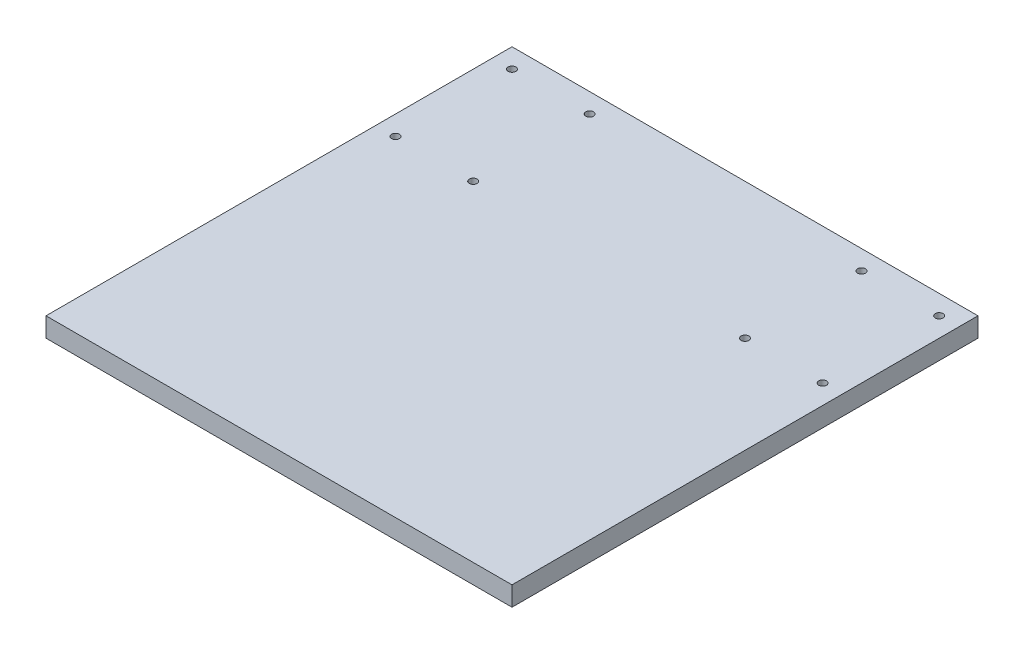
ISO-10303-21;
HEADER;
FILE_DESCRIPTION(('STEP AP214'),'2;1');
FILE_NAME('part.step','',(''),(''),'','','');
FILE_SCHEMA(('AUTOMOTIVE_DESIGN { 1 0 10303 214 1 1 1 1 }'));
ENDSEC;
DATA;
#1=APPLICATION_CONTEXT('core data for automotive mechanical design processes');
#2=APPLICATION_PROTOCOL_DEFINITION('international standard','automotive_design',2000,#1);
#3=PRODUCT_CONTEXT('',#1,'mechanical');
#4=PRODUCT('Part','Part','',(#3));
#5=PRODUCT_RELATED_PRODUCT_CATEGORY('part','',(#4));
#6=PRODUCT_DEFINITION_FORMATION('','',#4);
#7=PRODUCT_DEFINITION_CONTEXT('part definition',#1,'design');
#8=PRODUCT_DEFINITION('design','',#6,#7);
#9=PRODUCT_DEFINITION_SHAPE('','',#8);
#10=(LENGTH_UNIT() NAMED_UNIT(*) SI_UNIT(.MILLI.,.METRE.));
#11=(NAMED_UNIT(*) PLANE_ANGLE_UNIT() SI_UNIT($,.RADIAN.));
#12=(NAMED_UNIT(*) SI_UNIT($,.STERADIAN.) SOLID_ANGLE_UNIT());
#13=UNCERTAINTY_MEASURE_WITH_UNIT(LENGTH_MEASURE(1.E-05),#10,'distance_accuracy_value','');
#14=(GEOMETRIC_REPRESENTATION_CONTEXT(3) GLOBAL_UNCERTAINTY_ASSIGNED_CONTEXT((#13)) GLOBAL_UNIT_ASSIGNED_CONTEXT((#10,
#11,#12)) REPRESENTATION_CONTEXT('',''));
#15=CARTESIAN_POINT('',(0.,0.,0.));
#16=DIRECTION('',(0.,0.,1.));
#17=DIRECTION('',(1.,0.,0.));
#18=AXIS2_PLACEMENT_3D('',#15,#16,#17);
#19=CARTESIAN_POINT('',(0.,10.,0.));
#20=DIRECTION('',(0.,1.,0.));
#21=DIRECTION('',(0.,0.,1.));
#22=AXIS2_PLACEMENT_3D('',#19,#20,#21);
#23=PLANE('',#22);
#24=CARTESIAN_POINT('',(110.,10.,-50.0000000000002));
#25=DIRECTION('',(0.,1.,0.));
#26=DIRECTION('',(0.,0.,-1.));
#27=AXIS2_PLACEMENT_3D('',#24,#25,#26);
#28=CIRCLE('',#27,2.);
#29=CARTESIAN_POINT('',(110.,10.,-52.0000000000002));
#30=VERTEX_POINT('',#29);
#31=EDGE_CURVE('E145',#30,#30,#28,.T.);
#32=ORIENTED_EDGE('',*,*,#31,.F.);
#33=EDGE_LOOP('',(#32));
#34=FACE_BOUND('',#33,.T.);
#35=CARTESIAN_POINT('',(70.,10.,-50.0000000000001));
#36=DIRECTION('',(0.,1.,0.));
#37=DIRECTION('',(0.,0.,-1.));
#38=AXIS2_PLACEMENT_3D('',#35,#36,#37);
#39=CIRCLE('',#38,2.);
#40=CARTESIAN_POINT('',(70.,10.,-52.0000000000001));
#41=VERTEX_POINT('',#40);
#42=EDGE_CURVE('E133',#41,#41,#39,.T.);
#43=ORIENTED_EDGE('',*,*,#42,.F.);
#44=EDGE_LOOP('',(#43));
#45=FACE_BOUND('',#44,.T.);
#46=CARTESIAN_POINT('',(-70.,10.,-110.));
#47=DIRECTION('',(0.,1.,0.));
#48=DIRECTION('',(0.,0.,1.));
#49=AXIS2_PLACEMENT_3D('',#46,#47,#48);
#50=CIRCLE('',#49,2.);
#51=CARTESIAN_POINT('',(-70.,10.,-108.));
#52=VERTEX_POINT('',#51);
#53=EDGE_CURVE('E121',#52,#52,#50,.T.);
#54=ORIENTED_EDGE('',*,*,#53,.F.);
#55=EDGE_LOOP('',(#54));
#56=FACE_BOUND('',#55,.T.);
#57=CARTESIAN_POINT('',(-110.,10.,-110.));
#58=DIRECTION('',(0.,1.,0.));
#59=DIRECTION('',(0.,0.,1.));
#60=AXIS2_PLACEMENT_3D('',#57,#58,#59);
#61=CIRCLE('',#60,2.);
#62=CARTESIAN_POINT('',(-110.,10.,-108.));
#63=VERTEX_POINT('',#62);
#64=EDGE_CURVE('E100',#63,#63,#61,.T.);
#65=ORIENTED_EDGE('',*,*,#64,.F.);
#66=EDGE_LOOP('',(#65));
#67=FACE_BOUND('',#66,.T.);
#68=DIRECTION('',(0.,0.,-1.));
#69=VECTOR('',#68,1.);
#70=CARTESIAN_POINT('',(120.,10.,-120.));
#71=LINE('',#70,#69);
#72=CARTESIAN_POINT('',(120.,10.,120.));
#73=VERTEX_POINT('',#72);
#74=CARTESIAN_POINT('',(120.,10.,-120.));
#75=VERTEX_POINT('',#74);
#76=EDGE_CURVE('E85',#73,#75,#71,.T.);
#77=ORIENTED_EDGE('',*,*,#76,.T.);
#78=DIRECTION('',(-1.,0.,0.));
#79=VECTOR('',#78,1.);
#80=CARTESIAN_POINT('',(-120.,10.,-120.));
#81=LINE('',#80,#79);
#82=CARTESIAN_POINT('',(-120.,10.,-120.));
#83=VERTEX_POINT('',#82);
#84=EDGE_CURVE('E80',#75,#83,#81,.T.);
#85=ORIENTED_EDGE('',*,*,#84,.T.);
#86=DIRECTION('',(0.,0.,1.));
#87=VECTOR('',#86,1.);
#88=CARTESIAN_POINT('',(-120.,10.,-120.));
#89=LINE('',#88,#87);
#90=CARTESIAN_POINT('',(-120.,10.,120.));
#91=VERTEX_POINT('',#90);
#92=EDGE_CURVE('E83',#83,#91,#89,.T.);
#93=ORIENTED_EDGE('',*,*,#92,.T.);
#94=DIRECTION('',(1.,0.,0.));
#95=VECTOR('',#94,1.);
#96=CARTESIAN_POINT('',(-120.,10.,120.));
#97=LINE('',#96,#95);
#98=EDGE_CURVE('E50',#91,#73,#97,.T.);
#99=ORIENTED_EDGE('',*,*,#98,.T.);
#100=EDGE_LOOP('',(#77,#85,#93,#99));
#101=FACE_BOUND('',#100,.T.);
#102=CARTESIAN_POINT('',(-110.,10.,-50.));
#103=DIRECTION('',(0.,1.,0.));
#104=DIRECTION('',(0.,0.,1.));
#105=AXIS2_PLACEMENT_3D('',#102,#103,#104);
#106=CIRCLE('',#105,2.);
#107=CARTESIAN_POINT('',(-110.,10.,-48.));
#108=VERTEX_POINT('',#107);
#109=EDGE_CURVE('E115',#108,#108,#106,.T.);
#110=ORIENTED_EDGE('',*,*,#109,.F.);
#111=EDGE_LOOP('',(#110));
#112=FACE_BOUND('',#111,.T.);
#113=CARTESIAN_POINT('',(-70.,10.,-50.));
#114=DIRECTION('',(0.,1.,0.));
#115=DIRECTION('',(0.,0.,1.));
#116=AXIS2_PLACEMENT_3D('',#113,#114,#115);
#117=CIRCLE('',#116,2.);
#118=CARTESIAN_POINT('',(-70.,10.,-48.));
#119=VERTEX_POINT('',#118);
#120=EDGE_CURVE('E127',#119,#119,#117,.T.);
#121=ORIENTED_EDGE('',*,*,#120,.F.);
#122=EDGE_LOOP('',(#121));
#123=FACE_BOUND('',#122,.T.);
#124=CARTESIAN_POINT('',(69.9999999999999,10.,-110.));
#125=DIRECTION('',(0.,1.,0.));
#126=DIRECTION('',(0.,0.,-1.));
#127=AXIS2_PLACEMENT_3D('',#124,#125,#126);
#128=CIRCLE('',#127,2.);
#129=CARTESIAN_POINT('',(69.9999999999999,10.,-112.));
#130=VERTEX_POINT('',#129);
#131=EDGE_CURVE('E139',#130,#130,#128,.T.);
#132=ORIENTED_EDGE('',*,*,#131,.F.);
#133=EDGE_LOOP('',(#132));
#134=FACE_BOUND('',#133,.T.);
#135=CARTESIAN_POINT('',(110.,10.,-110.));
#136=DIRECTION('',(0.,1.,0.));
#137=DIRECTION('',(0.,0.,-1.));
#138=AXIS2_PLACEMENT_3D('',#135,#136,#137);
#139=CIRCLE('',#138,2.);
#140=CARTESIAN_POINT('',(110.,10.,-112.));
#141=VERTEX_POINT('',#140);
#142=EDGE_CURVE('E151',#141,#141,#139,.T.);
#143=ORIENTED_EDGE('',*,*,#142,.F.);
#144=EDGE_LOOP('',(#143));
#145=FACE_BOUND('',#144,.T.);
#146=ADVANCED_FACE('F33',(#34,#45,#56,#67,#101,#112,#123,#134,#145),#23,.T.);
#147=CARTESIAN_POINT('',(0.,0.,0.));
#148=DIRECTION('',(0.,1.,0.));
#149=DIRECTION('',(0.,0.,1.));
#150=AXIS2_PLACEMENT_3D('',#147,#148,#149);
#151=PLANE('',#150);
#152=DIRECTION('',(0.,0.,-1.));
#153=VECTOR('',#152,1.);
#154=CARTESIAN_POINT('',(120.,0.,-120.));
#155=LINE('',#154,#153);
#156=CARTESIAN_POINT('',(120.,0.,120.));
#157=VERTEX_POINT('',#156);
#158=CARTESIAN_POINT('',(120.,0.,-120.));
#159=VERTEX_POINT('',#158);
#160=EDGE_CURVE('E97',#157,#159,#155,.T.);
#161=ORIENTED_EDGE('',*,*,#160,.F.);
#162=DIRECTION('',(1.,0.,0.));
#163=VECTOR('',#162,1.);
#164=CARTESIAN_POINT('',(-120.,0.,120.));
#165=LINE('',#164,#163);
#166=CARTESIAN_POINT('',(-120.,0.,120.));
#167=VERTEX_POINT('',#166);
#168=EDGE_CURVE('E73',#167,#157,#165,.T.);
#169=ORIENTED_EDGE('',*,*,#168,.F.);
#170=DIRECTION('',(0.,0.,1.));
#171=VECTOR('',#170,1.);
#172=CARTESIAN_POINT('',(-120.,0.,-120.));
#173=LINE('',#172,#171);
#174=CARTESIAN_POINT('',(-120.,0.,-120.));
#175=VERTEX_POINT('',#174);
#176=EDGE_CURVE('E67',#175,#167,#173,.T.);
#177=ORIENTED_EDGE('',*,*,#176,.F.);
#178=DIRECTION('',(-1.,0.,0.));
#179=VECTOR('',#178,1.);
#180=CARTESIAN_POINT('',(-120.,0.,-120.));
#181=LINE('',#180,#179);
#182=EDGE_CURVE('E89',#159,#175,#181,.T.);
#183=ORIENTED_EDGE('',*,*,#182,.F.);
#184=EDGE_LOOP('',(#161,#169,#177,#183));
#185=FACE_BOUND('',#184,.T.);
#186=CARTESIAN_POINT('',(-110.,0.,-110.));
#187=DIRECTION('',(0.,1.,0.));
#188=DIRECTION('',(0.,0.,1.));
#189=AXIS2_PLACEMENT_3D('',#186,#187,#188);
#190=CIRCLE('',#189,2.);
#191=CARTESIAN_POINT('',(-110.,0.,-108.));
#192=VERTEX_POINT('',#191);
#193=EDGE_CURVE('E112',#192,#192,#190,.T.);
#194=ORIENTED_EDGE('',*,*,#193,.T.);
#195=EDGE_LOOP('',(#194));
#196=FACE_BOUND('',#195,.T.);
#197=CARTESIAN_POINT('',(-110.,0.,-50.));
#198=DIRECTION('',(0.,1.,0.));
#199=DIRECTION('',(0.,0.,1.));
#200=AXIS2_PLACEMENT_3D('',#197,#198,#199);
#201=CIRCLE('',#200,2.);
#202=CARTESIAN_POINT('',(-110.,0.,-48.));
#203=VERTEX_POINT('',#202);
#204=EDGE_CURVE('E118',#203,#203,#201,.T.);
#205=ORIENTED_EDGE('',*,*,#204,.T.);
#206=EDGE_LOOP('',(#205));
#207=FACE_BOUND('',#206,.T.);
#208=CARTESIAN_POINT('',(-70.,0.,-110.));
#209=DIRECTION('',(0.,1.,0.));
#210=DIRECTION('',(0.,0.,1.));
#211=AXIS2_PLACEMENT_3D('',#208,#209,#210);
#212=CIRCLE('',#211,2.);
#213=CARTESIAN_POINT('',(-70.,0.,-108.));
#214=VERTEX_POINT('',#213);
#215=EDGE_CURVE('E124',#214,#214,#212,.T.);
#216=ORIENTED_EDGE('',*,*,#215,.T.);
#217=EDGE_LOOP('',(#216));
#218=FACE_BOUND('',#217,.T.);
#219=CARTESIAN_POINT('',(-70.,0.,-50.));
#220=DIRECTION('',(0.,1.,0.));
#221=DIRECTION('',(0.,0.,1.));
#222=AXIS2_PLACEMENT_3D('',#219,#220,#221);
#223=CIRCLE('',#222,2.);
#224=CARTESIAN_POINT('',(-70.,0.,-48.));
#225=VERTEX_POINT('',#224);
#226=EDGE_CURVE('E130',#225,#225,#223,.T.);
#227=ORIENTED_EDGE('',*,*,#226,.T.);
#228=EDGE_LOOP('',(#227));
#229=FACE_BOUND('',#228,.T.);
#230=CARTESIAN_POINT('',(70.,0.,-50.0000000000001));
#231=DIRECTION('',(0.,1.,0.));
#232=DIRECTION('',(0.,0.,-1.));
#233=AXIS2_PLACEMENT_3D('',#230,#231,#232);
#234=CIRCLE('',#233,2.);
#235=CARTESIAN_POINT('',(70.,0.,-52.0000000000001));
#236=VERTEX_POINT('',#235);
#237=EDGE_CURVE('E136',#236,#236,#234,.T.);
#238=ORIENTED_EDGE('',*,*,#237,.T.);
#239=EDGE_LOOP('',(#238));
#240=FACE_BOUND('',#239,.T.);
#241=CARTESIAN_POINT('',(69.9999999999999,0.,-110.));
#242=DIRECTION('',(0.,1.,0.));
#243=DIRECTION('',(0.,0.,-1.));
#244=AXIS2_PLACEMENT_3D('',#241,#242,#243);
#245=CIRCLE('',#244,2.);
#246=CARTESIAN_POINT('',(69.9999999999999,0.,-112.));
#247=VERTEX_POINT('',#246);
#248=EDGE_CURVE('E142',#247,#247,#245,.T.);
#249=ORIENTED_EDGE('',*,*,#248,.T.);
#250=EDGE_LOOP('',(#249));
#251=FACE_BOUND('',#250,.T.);
#252=CARTESIAN_POINT('',(110.,0.,-50.0000000000002));
#253=DIRECTION('',(0.,1.,0.));
#254=DIRECTION('',(0.,0.,-1.));
#255=AXIS2_PLACEMENT_3D('',#252,#253,#254);
#256=CIRCLE('',#255,2.);
#257=CARTESIAN_POINT('',(110.,0.,-52.0000000000002));
#258=VERTEX_POINT('',#257);
#259=EDGE_CURVE('E148',#258,#258,#256,.T.);
#260=ORIENTED_EDGE('',*,*,#259,.T.);
#261=EDGE_LOOP('',(#260));
#262=FACE_BOUND('',#261,.T.);
#263=CARTESIAN_POINT('',(110.,0.,-110.));
#264=DIRECTION('',(0.,1.,0.));
#265=DIRECTION('',(0.,0.,-1.));
#266=AXIS2_PLACEMENT_3D('',#263,#264,#265);
#267=CIRCLE('',#266,2.);
#268=CARTESIAN_POINT('',(110.,0.,-112.));
#269=VERTEX_POINT('',#268);
#270=EDGE_CURVE('E154',#269,#269,#267,.T.);
#271=ORIENTED_EDGE('',*,*,#270,.T.);
#272=EDGE_LOOP('',(#271));
#273=FACE_BOUND('',#272,.T.);
#274=ADVANCED_FACE('F108',(#185,#196,#207,#218,#229,#240,#251,#262,#273),#151,.F.);
#275=CARTESIAN_POINT('',(120.,10.,-120.));
#276=DIRECTION('',(-1.,0.,0.));
#277=DIRECTION('',(0.,0.,1.));
#278=AXIS2_PLACEMENT_3D('',#275,#276,#277);
#279=PLANE('',#278);
#280=ORIENTED_EDGE('',*,*,#160,.T.);
#281=DIRECTION('',(0.,-1.,0.));
#282=VECTOR('',#281,1.);
#283=CARTESIAN_POINT('',(120.,10.,-120.));
#284=LINE('',#283,#282);
#285=EDGE_CURVE('E11',#75,#159,#284,.T.);
#286=ORIENTED_EDGE('',*,*,#285,.F.);
#287=ORIENTED_EDGE('',*,*,#76,.F.);
#288=DIRECTION('',(0.,-1.,0.));
#289=VECTOR('',#288,1.);
#290=CARTESIAN_POINT('',(120.,10.,120.));
#291=LINE('',#290,#289);
#292=EDGE_CURVE('E93',#73,#157,#291,.T.);
#293=ORIENTED_EDGE('',*,*,#292,.T.);
#294=EDGE_LOOP('',(#280,#286,#287,#293));
#295=FACE_BOUND('',#294,.T.);
#296=ADVANCED_FACE('F35',(#295),#279,.F.);
#297=CARTESIAN_POINT('',(-120.,10.,-120.));
#298=DIRECTION('',(0.,0.,1.));
#299=DIRECTION('',(1.,0.,0.));
#300=AXIS2_PLACEMENT_3D('',#297,#298,#299);
#301=PLANE('',#300);
#302=ORIENTED_EDGE('',*,*,#182,.T.);
#303=DIRECTION('',(0.,-1.,0.));
#304=VECTOR('',#303,1.);
#305=CARTESIAN_POINT('',(-120.,10.,-120.));
#306=LINE('',#305,#304);
#307=EDGE_CURVE('E42',#83,#175,#306,.T.);
#308=ORIENTED_EDGE('',*,*,#307,.F.);
#309=ORIENTED_EDGE('',*,*,#84,.F.);
#310=ORIENTED_EDGE('',*,*,#285,.T.);
#311=EDGE_LOOP('',(#302,#308,#309,#310));
#312=FACE_BOUND('',#311,.T.);
#313=ADVANCED_FACE('F88',(#312),#301,.F.);
#314=CARTESIAN_POINT('',(-120.,10.,-120.));
#315=DIRECTION('',(1.,0.,0.));
#316=DIRECTION('',(0.,0.,-1.));
#317=AXIS2_PLACEMENT_3D('',#314,#315,#316);
#318=PLANE('',#317);
#319=ORIENTED_EDGE('',*,*,#176,.T.);
#320=DIRECTION('',(0.,-1.,0.));
#321=VECTOR('',#320,1.);
#322=CARTESIAN_POINT('',(-120.,10.,120.));
#323=LINE('',#322,#321);
#324=EDGE_CURVE('E90',#91,#167,#323,.T.);
#325=ORIENTED_EDGE('',*,*,#324,.F.);
#326=ORIENTED_EDGE('',*,*,#92,.F.);
#327=ORIENTED_EDGE('',*,*,#307,.T.);
#328=EDGE_LOOP('',(#319,#325,#326,#327));
#329=FACE_BOUND('',#328,.T.);
#330=ADVANCED_FACE('F91',(#329),#318,.F.);
#331=CARTESIAN_POINT('',(-120.,10.,120.));
#332=DIRECTION('',(0.,0.,-1.));
#333=DIRECTION('',(-1.,0.,0.));
#334=AXIS2_PLACEMENT_3D('',#331,#332,#333);
#335=PLANE('',#334);
#336=ORIENTED_EDGE('',*,*,#168,.T.);
#337=ORIENTED_EDGE('',*,*,#292,.F.);
#338=ORIENTED_EDGE('',*,*,#98,.F.);
#339=ORIENTED_EDGE('',*,*,#324,.T.);
#340=EDGE_LOOP('',(#336,#337,#338,#339));
#341=FACE_BOUND('',#340,.T.);
#342=ADVANCED_FACE('F105',(#341),#335,.F.);
#343=CARTESIAN_POINT('',(-110.,10.,-110.));
#344=DIRECTION('',(0.,-1.,0.));
#345=DIRECTION('',(0.,0.,-1.));
#346=AXIS2_PLACEMENT_3D('',#343,#344,#345);
#347=CYLINDRICAL_SURFACE('',#346,2.);
#348=ORIENTED_EDGE('',*,*,#64,.T.);
#349=EDGE_LOOP('',(#348));
#350=FACE_BOUND('',#349,.T.);
#351=ORIENTED_EDGE('',*,*,#193,.F.);
#352=EDGE_LOOP('',(#351));
#353=FACE_BOUND('',#352,.T.);
#354=ADVANCED_FACE('F173',(#350,#353),#347,.F.);
#355=CARTESIAN_POINT('',(-110.,10.,-50.));
#356=DIRECTION('',(0.,-1.,0.));
#357=DIRECTION('',(0.,0.,-1.));
#358=AXIS2_PLACEMENT_3D('',#355,#356,#357);
#359=CYLINDRICAL_SURFACE('',#358,2.);
#360=ORIENTED_EDGE('',*,*,#109,.T.);
#361=EDGE_LOOP('',(#360));
#362=FACE_BOUND('',#361,.T.);
#363=ORIENTED_EDGE('',*,*,#204,.F.);
#364=EDGE_LOOP('',(#363));
#365=FACE_BOUND('',#364,.T.);
#366=ADVANCED_FACE('F219',(#362,#365),#359,.F.);
#367=CARTESIAN_POINT('',(-70.,10.,-110.));
#368=DIRECTION('',(0.,-1.,0.));
#369=DIRECTION('',(0.,0.,-1.));
#370=AXIS2_PLACEMENT_3D('',#367,#368,#369);
#371=CYLINDRICAL_SURFACE('',#370,2.);
#372=ORIENTED_EDGE('',*,*,#53,.T.);
#373=EDGE_LOOP('',(#372));
#374=FACE_BOUND('',#373,.T.);
#375=ORIENTED_EDGE('',*,*,#215,.F.);
#376=EDGE_LOOP('',(#375));
#377=FACE_BOUND('',#376,.T.);
#378=ADVANCED_FACE('F227',(#374,#377),#371,.F.);
#379=CARTESIAN_POINT('',(-70.,10.,-50.));
#380=DIRECTION('',(0.,-1.,0.));
#381=DIRECTION('',(0.,0.,-1.));
#382=AXIS2_PLACEMENT_3D('',#379,#380,#381);
#383=CYLINDRICAL_SURFACE('',#382,2.);
#384=ORIENTED_EDGE('',*,*,#120,.T.);
#385=EDGE_LOOP('',(#384));
#386=FACE_BOUND('',#385,.T.);
#387=ORIENTED_EDGE('',*,*,#226,.F.);
#388=EDGE_LOOP('',(#387));
#389=FACE_BOUND('',#388,.T.);
#390=ADVANCED_FACE('F235',(#386,#389),#383,.F.);
#391=CARTESIAN_POINT('',(70.,10.,-50.0000000000001));
#392=DIRECTION('',(0.,-1.,0.));
#393=DIRECTION('',(0.,0.,-1.));
#394=AXIS2_PLACEMENT_3D('',#391,#392,#393);
#395=CYLINDRICAL_SURFACE('',#394,2.);
#396=ORIENTED_EDGE('',*,*,#42,.T.);
#397=EDGE_LOOP('',(#396));
#398=FACE_BOUND('',#397,.T.);
#399=ORIENTED_EDGE('',*,*,#237,.F.);
#400=EDGE_LOOP('',(#399));
#401=FACE_BOUND('',#400,.T.);
#402=ADVANCED_FACE('F244',(#398,#401),#395,.F.);
#403=CARTESIAN_POINT('',(69.9999999999999,10.,-110.));
#404=DIRECTION('',(0.,-1.,0.));
#405=DIRECTION('',(0.,0.,-1.));
#406=AXIS2_PLACEMENT_3D('',#403,#404,#405);
#407=CYLINDRICAL_SURFACE('',#406,2.);
#408=ORIENTED_EDGE('',*,*,#131,.T.);
#409=EDGE_LOOP('',(#408));
#410=FACE_BOUND('',#409,.T.);
#411=ORIENTED_EDGE('',*,*,#248,.F.);
#412=EDGE_LOOP('',(#411));
#413=FACE_BOUND('',#412,.T.);
#414=ADVANCED_FACE('F253',(#410,#413),#407,.F.);
#415=CARTESIAN_POINT('',(110.,10.,-50.0000000000002));
#416=DIRECTION('',(0.,-1.,0.));
#417=DIRECTION('',(0.,0.,-1.));
#418=AXIS2_PLACEMENT_3D('',#415,#416,#417);
#419=CYLINDRICAL_SURFACE('',#418,2.);
#420=ORIENTED_EDGE('',*,*,#31,.T.);
#421=EDGE_LOOP('',(#420));
#422=FACE_BOUND('',#421,.T.);
#423=ORIENTED_EDGE('',*,*,#259,.F.);
#424=EDGE_LOOP('',(#423));
#425=FACE_BOUND('',#424,.T.);
#426=ADVANCED_FACE('F262',(#422,#425),#419,.F.);
#427=CARTESIAN_POINT('',(110.,10.,-110.));
#428=DIRECTION('',(0.,-1.,0.));
#429=DIRECTION('',(0.,0.,-1.));
#430=AXIS2_PLACEMENT_3D('',#427,#428,#429);
#431=CYLINDRICAL_SURFACE('',#430,2.);
#432=ORIENTED_EDGE('',*,*,#142,.T.);
#433=EDGE_LOOP('',(#432));
#434=FACE_BOUND('',#433,.T.);
#435=ORIENTED_EDGE('',*,*,#270,.F.);
#436=EDGE_LOOP('',(#435));
#437=FACE_BOUND('',#436,.T.);
#438=ADVANCED_FACE('F160',(#434,#437),#431,.F.);
#439=CLOSED_SHELL('',(#146,#274,#296,#313,#330,#342,#354,#366,#378,#390,#402,#414,#426,#438));
#440=MANIFOLD_SOLID_BREP('B2',#439);
#441=ADVANCED_BREP_SHAPE_REPRESENTATION('',(#18,#440),#14);
#442=SHAPE_DEFINITION_REPRESENTATION(#9,#441);
ENDSEC;
END-ISO-10303-21;
